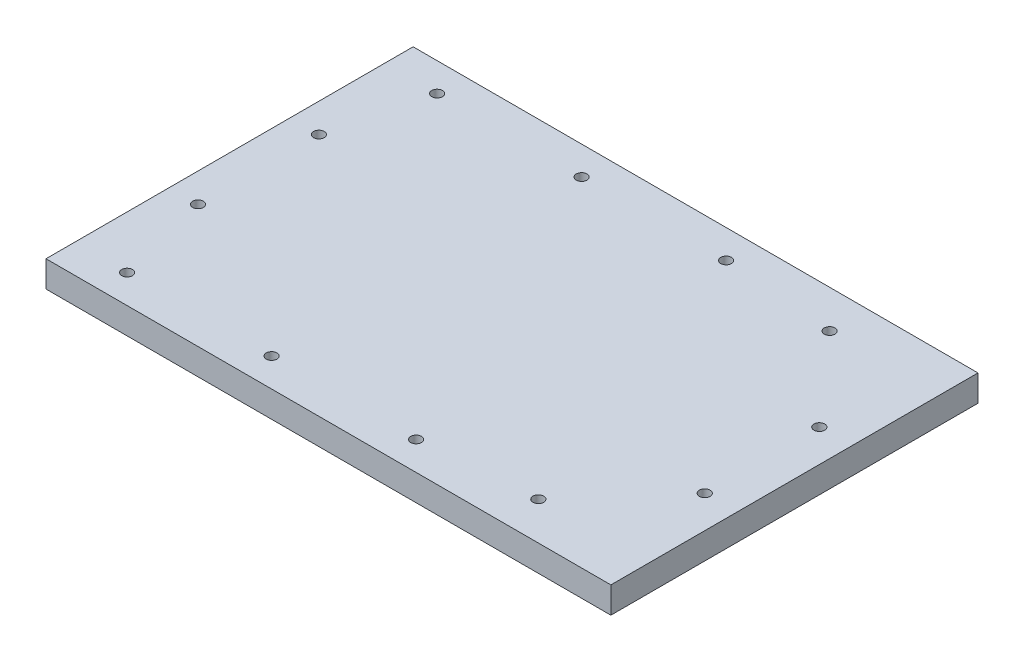
ISO-10303-21;
HEADER;
FILE_DESCRIPTION(('STEP AP214'),'2;1');
FILE_NAME('part.step','',(''),(''),'','','');
FILE_SCHEMA(('AUTOMOTIVE_DESIGN { 1 0 10303 214 1 1 1 1 }'));
ENDSEC;
DATA;
#1=APPLICATION_CONTEXT('core data for automotive mechanical design processes');
#2=APPLICATION_PROTOCOL_DEFINITION('international standard','automotive_design',2000,#1);
#3=PRODUCT_CONTEXT('',#1,'mechanical');
#4=PRODUCT('Part','Part','',(#3));
#5=PRODUCT_RELATED_PRODUCT_CATEGORY('part','',(#4));
#6=PRODUCT_DEFINITION_FORMATION('','',#4);
#7=PRODUCT_DEFINITION_CONTEXT('part definition',#1,'design');
#8=PRODUCT_DEFINITION('design','',#6,#7);
#9=PRODUCT_DEFINITION_SHAPE('','',#8);
#10=(LENGTH_UNIT() NAMED_UNIT(*) SI_UNIT(.MILLI.,.METRE.));
#11=(NAMED_UNIT(*) PLANE_ANGLE_UNIT() SI_UNIT($,.RADIAN.));
#12=(NAMED_UNIT(*) SI_UNIT($,.STERADIAN.) SOLID_ANGLE_UNIT());
#13=UNCERTAINTY_MEASURE_WITH_UNIT(LENGTH_MEASURE(1.E-05),#10,'distance_accuracy_value','');
#14=(GEOMETRIC_REPRESENTATION_CONTEXT(3) GLOBAL_UNCERTAINTY_ASSIGNED_CONTEXT((#13)) GLOBAL_UNIT_ASSIGNED_CONTEXT((#10,
#11,#12)) REPRESENTATION_CONTEXT('',''));
#15=CARTESIAN_POINT('',(0.,0.,0.));
#16=DIRECTION('',(0.,0.,1.));
#17=DIRECTION('',(1.,0.,0.));
#18=AXIS2_PLACEMENT_3D('',#15,#16,#17);
#19=CARTESIAN_POINT('',(215.,10.,0.133560895770796));
#20=DIRECTION('',(-1.,0.,0.));
#21=DIRECTION('',(0.,0.,1.));
#22=AXIS2_PLACEMENT_3D('',#19,#20,#21);
#23=PLANE('',#22);
#24=DIRECTION('',(0.,0.,-1.));
#25=VECTOR('',#24,1.);
#26=CARTESIAN_POINT('',(215.,0.,0.133560895770796));
#27=LINE('',#26,#25);
#28=CARTESIAN_POINT('',(215.,0.,139.866439104229));
#29=VERTEX_POINT('',#28);
#30=CARTESIAN_POINT('',(215.,0.,0.133560895770796));
#31=VERTEX_POINT('',#30);
#32=EDGE_CURVE('E103',#29,#31,#27,.T.);
#33=ORIENTED_EDGE('',*,*,#32,.T.);
#34=DIRECTION('',(0.,-1.,0.));
#35=VECTOR('',#34,1.);
#36=CARTESIAN_POINT('',(215.,10.,0.133560895770796));
#37=LINE('',#36,#35);
#38=CARTESIAN_POINT('',(215.,10.,0.133560895770796));
#39=VERTEX_POINT('',#38);
#40=EDGE_CURVE('E11',#39,#31,#37,.T.);
#41=ORIENTED_EDGE('',*,*,#40,.F.);
#42=DIRECTION('',(0.,0.,-1.));
#43=VECTOR('',#42,1.);
#44=CARTESIAN_POINT('',(215.,10.,0.133560895770796));
#45=LINE('',#44,#43);
#46=CARTESIAN_POINT('',(215.,10.,139.866439104229));
#47=VERTEX_POINT('',#46);
#48=EDGE_CURVE('E90',#47,#39,#45,.T.);
#49=ORIENTED_EDGE('',*,*,#48,.F.);
#50=DIRECTION('',(0.,-1.,0.));
#51=VECTOR('',#50,1.);
#52=CARTESIAN_POINT('',(215.,10.,139.866439104229));
#53=LINE('',#52,#51);
#54=EDGE_CURVE('E99',#47,#29,#53,.T.);
#55=ORIENTED_EDGE('',*,*,#54,.T.);
#56=EDGE_LOOP('',(#33,#41,#49,#55));
#57=FACE_BOUND('',#56,.T.);
#58=ADVANCED_FACE('F37',(#57),#23,.F.);
#59=CARTESIAN_POINT('',(215.,10.,0.133560895770796));
#60=DIRECTION('',(0.,0.,1.));
#61=DIRECTION('',(1.,0.,0.));
#62=AXIS2_PLACEMENT_3D('',#59,#60,#61);
#63=PLANE('',#62);
#64=DIRECTION('',(-1.,0.,0.));
#65=VECTOR('',#64,1.);
#66=CARTESIAN_POINT('',(215.,0.,0.133560895770796));
#67=LINE('',#66,#65);
#68=CARTESIAN_POINT('',(0.,0.,0.133560895770796));
#69=VERTEX_POINT('',#68);
#70=EDGE_CURVE('E94',#31,#69,#67,.T.);
#71=ORIENTED_EDGE('',*,*,#70,.T.);
#72=DIRECTION('',(0.,-1.,0.));
#73=VECTOR('',#72,1.);
#74=CARTESIAN_POINT('',(0.,10.,0.133560895770796));
#75=LINE('',#74,#73);
#76=CARTESIAN_POINT('',(0.,10.,0.133560895770796));
#77=VERTEX_POINT('',#76);
#78=EDGE_CURVE('E46',#77,#69,#75,.T.);
#79=ORIENTED_EDGE('',*,*,#78,.F.);
#80=DIRECTION('',(-1.,0.,0.));
#81=VECTOR('',#80,1.);
#82=CARTESIAN_POINT('',(215.,10.,0.133560895770796));
#83=LINE('',#82,#81);
#84=EDGE_CURVE('E85',#39,#77,#83,.T.);
#85=ORIENTED_EDGE('',*,*,#84,.F.);
#86=ORIENTED_EDGE('',*,*,#40,.T.);
#87=EDGE_LOOP('',(#71,#79,#85,#86));
#88=FACE_BOUND('',#87,.T.);
#89=ADVANCED_FACE('F93',(#88),#63,.F.);
#90=CARTESIAN_POINT('',(0.,10.,0.133560895770796));
#91=DIRECTION('',(1.,0.,0.));
#92=DIRECTION('',(0.,0.,-1.));
#93=AXIS2_PLACEMENT_3D('',#90,#91,#92);
#94=PLANE('',#93);
#95=DIRECTION('',(0.,0.,1.));
#96=VECTOR('',#95,1.);
#97=CARTESIAN_POINT('',(0.,0.,0.133560895770796));
#98=LINE('',#97,#96);
#99=CARTESIAN_POINT('',(0.,0.,139.866439104229));
#100=VERTEX_POINT('',#99);
#101=EDGE_CURVE('E72',#69,#100,#98,.T.);
#102=ORIENTED_EDGE('',*,*,#101,.T.);
#103=DIRECTION('',(0.,-1.,0.));
#104=VECTOR('',#103,1.);
#105=CARTESIAN_POINT('',(0.,10.,139.866439104229));
#106=LINE('',#105,#104);
#107=CARTESIAN_POINT('',(0.,10.,139.866439104229));
#108=VERTEX_POINT('',#107);
#109=EDGE_CURVE('E95',#108,#100,#106,.T.);
#110=ORIENTED_EDGE('',*,*,#109,.F.);
#111=DIRECTION('',(0.,0.,1.));
#112=VECTOR('',#111,1.);
#113=CARTESIAN_POINT('',(0.,10.,0.133560895770796));
#114=LINE('',#113,#112);
#115=EDGE_CURVE('E88',#77,#108,#114,.T.);
#116=ORIENTED_EDGE('',*,*,#115,.F.);
#117=ORIENTED_EDGE('',*,*,#78,.T.);
#118=EDGE_LOOP('',(#102,#110,#116,#117));
#119=FACE_BOUND('',#118,.T.);
#120=ADVANCED_FACE('F97',(#119),#94,.F.);
#121=CARTESIAN_POINT('',(215.,10.,139.866439104229));
#122=DIRECTION('',(0.,0.,-1.));
#123=DIRECTION('',(-1.,0.,0.));
#124=AXIS2_PLACEMENT_3D('',#121,#122,#123);
#125=PLANE('',#124);
#126=DIRECTION('',(1.,0.,0.));
#127=VECTOR('',#126,1.);
#128=CARTESIAN_POINT('',(215.,0.,139.866439104229));
#129=LINE('',#128,#127);
#130=EDGE_CURVE('E78',#100,#29,#129,.T.);
#131=ORIENTED_EDGE('',*,*,#130,.T.);
#132=ORIENTED_EDGE('',*,*,#54,.F.);
#133=DIRECTION('',(1.,0.,0.));
#134=VECTOR('',#133,1.);
#135=CARTESIAN_POINT('',(215.,10.,139.866439104229));
#136=LINE('',#135,#134);
#137=EDGE_CURVE('E55',#108,#47,#136,.T.);
#138=ORIENTED_EDGE('',*,*,#137,.F.);
#139=ORIENTED_EDGE('',*,*,#109,.T.);
#140=EDGE_LOOP('',(#131,#132,#138,#139));
#141=FACE_BOUND('',#140,.T.);
#142=ADVANCED_FACE('F179',(#141),#125,.F.);
#143=CARTESIAN_POINT('',(0.,10.,0.));
#144=DIRECTION('',(0.,-1.,0.));
#145=DIRECTION('',(0.,0.,-1.));
#146=AXIS2_PLACEMENT_3D('',#143,#144,#145);
#147=PLANE('',#146);
#148=CARTESIAN_POINT('',(11.0000002854057,10.,93.0000013997593));
#149=DIRECTION('',(0.,1.,0.));
#150=DIRECTION('',(0.,0.,1.));
#151=AXIS2_PLACEMENT_3D('',#148,#149,#150);
#152=CIRCLE('',#151,2.05000150168221);
#153=CARTESIAN_POINT('',(11.0000002854057,10.,95.0500029014415));
#154=VERTEX_POINT('',#153);
#155=EDGE_CURVE('E341',#154,#154,#152,.T.);
#156=ORIENTED_EDGE('',*,*,#155,.F.);
#157=EDGE_LOOP('',(#156));
#158=FACE_BOUND('',#157,.T.);
#159=CARTESIAN_POINT('',(10.9999998365835,10.,47.0000009935121));
#160=DIRECTION('',(0.,1.,0.));
#161=DIRECTION('',(0.,0.,1.));
#162=AXIS2_PLACEMENT_3D('',#159,#160,#161);
#163=CIRCLE('',#162,2.05000191681124);
#164=CARTESIAN_POINT('',(10.9999998365835,10.,49.0500029103234));
#165=VERTEX_POINT('',#164);
#166=EDGE_CURVE('E338',#165,#165,#163,.T.);
#167=ORIENTED_EDGE('',*,*,#166,.F.);
#168=EDGE_LOOP('',(#167));
#169=FACE_BOUND('',#168,.T.);
#170=CARTESIAN_POINT('',(20.0000048740137,10.,11.0000011958167));
#171=DIRECTION('',(0.,1.,0.));
#172=DIRECTION('',(0.,0.,1.));
#173=AXIS2_PLACEMENT_3D('',#170,#171,#172);
#174=CIRCLE('',#173,2.05000055715237);
#175=CARTESIAN_POINT('',(20.0000048740137,10.,13.0500017529691));
#176=VERTEX_POINT('',#175);
#177=EDGE_CURVE('E340',#176,#176,#174,.T.);
#178=ORIENTED_EDGE('',*,*,#177,.F.);
#179=EDGE_LOOP('',(#178));
#180=FACE_BOUND('',#179,.T.);
#181=CARTESIAN_POINT('',(75.0000002625459,10.,10.9999990840569));
#182=DIRECTION('',(0.,1.,0.));
#183=DIRECTION('',(0.,0.,1.));
#184=AXIS2_PLACEMENT_3D('',#181,#182,#183);
#185=CIRCLE('',#184,2.05000022846606);
#186=CARTESIAN_POINT('',(75.0000002625459,10.,13.0499993125229));
#187=VERTEX_POINT('',#186);
#188=EDGE_CURVE('E344',#187,#187,#185,.T.);
#189=ORIENTED_EDGE('',*,*,#188,.F.);
#190=EDGE_LOOP('',(#189));
#191=FACE_BOUND('',#190,.T.);
#192=CARTESIAN_POINT('',(130.000001693621,10.,10.999999377587));
#193=DIRECTION('',(0.,1.,0.));
#194=DIRECTION('',(0.,0.,1.));
#195=AXIS2_PLACEMENT_3D('',#192,#193,#194);
#196=CIRCLE('',#195,2.05000052199691);
#197=CARTESIAN_POINT('',(130.000001693621,10.,13.049999899584));
#198=VERTEX_POINT('',#197);
#199=EDGE_CURVE('E374',#198,#198,#196,.T.);
#200=ORIENTED_EDGE('',*,*,#199,.F.);
#201=EDGE_LOOP('',(#200));
#202=FACE_BOUND('',#201,.T.);
#203=CARTESIAN_POINT('',(172.961008674686,10.,14.5672297045611));
#204=DIRECTION('',(0.,1.,0.));
#205=DIRECTION('',(0.,0.,1.));
#206=AXIS2_PLACEMENT_3D('',#203,#204,#205);
#207=CIRCLE('',#206,2.04999872564438);
#208=CARTESIAN_POINT('',(172.961008674686,10.,16.6172284302055));
#209=VERTEX_POINT('',#208);
#210=EDGE_CURVE('E371',#209,#209,#207,.T.);
#211=ORIENTED_EDGE('',*,*,#210,.F.);
#212=EDGE_LOOP('',(#211));
#213=FACE_BOUND('',#212,.T.);
#214=CARTESIAN_POINT('',(202.661143568672,10.,48.18704294095));
#215=DIRECTION('',(0.,1.,0.));
#216=DIRECTION('',(0.,0.,1.));
#217=AXIS2_PLACEMENT_3D('',#214,#215,#216);
#218=CIRCLE('',#217,2.05000166957498);
#219=CARTESIAN_POINT('',(202.661143568672,10.,50.237044610525));
#220=VERTEX_POINT('',#219);
#221=EDGE_CURVE('E368',#220,#220,#218,.T.);
#222=ORIENTED_EDGE('',*,*,#221,.F.);
#223=EDGE_LOOP('',(#222));
#224=FACE_BOUND('',#223,.T.);
#225=CARTESIAN_POINT('',(202.6611328125,10.,91.8129600494126));
#226=DIRECTION('',(0.,1.,0.));
#227=DIRECTION('',(0.,0.,1.));
#228=AXIS2_PLACEMENT_3D('',#225,#226,#227);
#229=CIRCLE('',#228,2.05000488985599);
#230=CARTESIAN_POINT('',(202.6611328125,10.,93.8629649392686));
#231=VERTEX_POINT('',#230);
#232=EDGE_CURVE('E365',#231,#231,#229,.T.);
#233=ORIENTED_EDGE('',*,*,#232,.F.);
#234=EDGE_LOOP('',(#233));
#235=FACE_BOUND('',#234,.T.);
#236=CARTESIAN_POINT('',(172.961008423725,10.,125.432773785052));
#237=DIRECTION('',(0.,1.,0.));
#238=DIRECTION('',(0.,0.,1.));
#239=AXIS2_PLACEMENT_3D('',#236,#237,#238);
#240=CIRCLE('',#239,2.05000301024418);
#241=CARTESIAN_POINT('',(172.961008423725,10.,127.482776795296));
#242=VERTEX_POINT('',#241);
#243=EDGE_CURVE('E360',#242,#242,#240,.T.);
#244=ORIENTED_EDGE('',*,*,#243,.F.);
#245=EDGE_LOOP('',(#244));
#246=FACE_BOUND('',#245,.T.);
#247=CARTESIAN_POINT('',(130.00000186359,10.,128.999997495006));
#248=DIRECTION('',(0.,1.,0.));
#249=DIRECTION('',(0.,0.,1.));
#250=AXIS2_PLACEMENT_3D('',#247,#248,#249);
#251=CIRCLE('',#250,2.04999803591313);
#252=CARTESIAN_POINT('',(130.00000186359,10.,131.049995530919));
#253=VERTEX_POINT('',#252);
#254=EDGE_CURVE('E355',#253,#253,#251,.T.);
#255=ORIENTED_EDGE('',*,*,#254,.F.);
#256=EDGE_LOOP('',(#255));
#257=FACE_BOUND('',#256,.T.);
#258=CARTESIAN_POINT('',(74.9999997416251,10.,129.000001143844));
#259=DIRECTION('',(0.,1.,0.));
#260=DIRECTION('',(0.,0.,1.));
#261=AXIS2_PLACEMENT_3D('',#258,#259,#260);
#262=CIRCLE('',#261,2.04999620106591);
#263=CARTESIAN_POINT('',(74.9999997416251,10.,131.04999734491));
#264=VERTEX_POINT('',#263);
#265=EDGE_CURVE('E351',#264,#264,#262,.T.);
#266=ORIENTED_EDGE('',*,*,#265,.F.);
#267=EDGE_LOOP('',(#266));
#268=FACE_BOUND('',#267,.T.);
#269=CARTESIAN_POINT('',(20.0000030766647,10.,129.000001763663));
#270=DIRECTION('',(0.,1.,0.));
#271=DIRECTION('',(0.,0.,1.));
#272=AXIS2_PLACEMENT_3D('',#269,#270,#271);
#273=CIRCLE('',#272,2.04999698036307);
#274=CARTESIAN_POINT('',(20.0000030766647,10.,131.049998744026));
#275=VERTEX_POINT('',#274);
#276=EDGE_CURVE('E115',#275,#275,#273,.T.);
#277=ORIENTED_EDGE('',*,*,#276,.F.);
#278=EDGE_LOOP('',(#277));
#279=FACE_BOUND('',#278,.T.);
#280=ORIENTED_EDGE('',*,*,#48,.T.);
#281=ORIENTED_EDGE('',*,*,#84,.T.);
#282=ORIENTED_EDGE('',*,*,#115,.T.);
#283=ORIENTED_EDGE('',*,*,#137,.T.);
#284=EDGE_LOOP('',(#280,#281,#282,#283));
#285=FACE_BOUND('',#284,.T.);
#286=ADVANCED_FACE('F86',(#158,#169,#180,#191,#202,#213,#224,#235,#246,#257,#268,#279,#285),
#147,.F.);
#287=CARTESIAN_POINT('',(0.,0.,0.));
#288=DIRECTION('',(0.,-1.,0.));
#289=DIRECTION('',(0.,0.,-1.));
#290=AXIS2_PLACEMENT_3D('',#287,#288,#289);
#291=PLANE('',#290);
#292=CARTESIAN_POINT('',(11.0000002854057,0.,93.0000013997593));
#293=DIRECTION('',(0.,-1.,0.));
#294=DIRECTION('',(0.,0.,-1.));
#295=AXIS2_PLACEMENT_3D('',#292,#293,#294);
#296=CIRCLE('',#295,2.05000150168221);
#297=CARTESIAN_POINT('',(11.0000002854057,0.,90.9499998980771));
#298=VERTEX_POINT('',#297);
#299=EDGE_CURVE('E40',#298,#298,#296,.T.);
#300=ORIENTED_EDGE('',*,*,#299,.F.);
#301=EDGE_LOOP('',(#300));
#302=FACE_BOUND('',#301,.T.);
#303=CARTESIAN_POINT('',(10.9999998365835,0.,47.0000009935121));
#304=DIRECTION('',(0.,-1.,0.));
#305=DIRECTION('',(0.,0.,-1.));
#306=AXIS2_PLACEMENT_3D('',#303,#304,#305);
#307=CIRCLE('',#306,2.05000191681124);
#308=CARTESIAN_POINT('',(10.9999998365835,0.,44.9499990767009));
#309=VERTEX_POINT('',#308);
#310=EDGE_CURVE('E141',#309,#309,#307,.T.);
#311=ORIENTED_EDGE('',*,*,#310,.F.);
#312=EDGE_LOOP('',(#311));
#313=FACE_BOUND('',#312,.T.);
#314=CARTESIAN_POINT('',(20.0000048740137,0.,11.0000011958167));
#315=DIRECTION('',(0.,-1.,0.));
#316=DIRECTION('',(0.,0.,-1.));
#317=AXIS2_PLACEMENT_3D('',#314,#315,#316);
#318=CIRCLE('',#317,2.05000055715237);
#319=CARTESIAN_POINT('',(20.0000048740137,0.,8.95000063866435));
#320=VERTEX_POINT('',#319);
#321=EDGE_CURVE('E139',#320,#320,#318,.T.);
#322=ORIENTED_EDGE('',*,*,#321,.F.);
#323=EDGE_LOOP('',(#322));
#324=FACE_BOUND('',#323,.T.);
#325=CARTESIAN_POINT('',(75.0000002625459,0.,10.9999990840569));
#326=DIRECTION('',(0.,-1.,0.));
#327=DIRECTION('',(0.,0.,-1.));
#328=AXIS2_PLACEMENT_3D('',#325,#326,#327);
#329=CIRCLE('',#328,2.05000022846606);
#330=CARTESIAN_POINT('',(75.0000002625459,0.,8.9499988555908));
#331=VERTEX_POINT('',#330);
#332=EDGE_CURVE('E136',#331,#331,#329,.T.);
#333=ORIENTED_EDGE('',*,*,#332,.F.);
#334=EDGE_LOOP('',(#333));
#335=FACE_BOUND('',#334,.T.);
#336=CARTESIAN_POINT('',(130.000001693621,0.,10.999999377587));
#337=DIRECTION('',(0.,-1.,0.));
#338=DIRECTION('',(0.,0.,-1.));
#339=AXIS2_PLACEMENT_3D('',#336,#337,#338);
#340=CIRCLE('',#339,2.05000052199691);
#341=CARTESIAN_POINT('',(130.000001693621,0.,8.94999885559013));
#342=VERTEX_POINT('',#341);
#343=EDGE_CURVE('E133',#342,#342,#340,.T.);
#344=ORIENTED_EDGE('',*,*,#343,.F.);
#345=EDGE_LOOP('',(#344));
#346=FACE_BOUND('',#345,.T.);
#347=CARTESIAN_POINT('',(172.961008674686,0.,14.5672297045611));
#348=DIRECTION('',(0.,-1.,0.));
#349=DIRECTION('',(0.,0.,-1.));
#350=AXIS2_PLACEMENT_3D('',#347,#348,#349);
#351=CIRCLE('',#350,2.04999872564438);
#352=CARTESIAN_POINT('',(172.961008674686,0.,12.5172309789168));
#353=VERTEX_POINT('',#352);
#354=EDGE_CURVE('E130',#353,#353,#351,.T.);
#355=ORIENTED_EDGE('',*,*,#354,.F.);
#356=EDGE_LOOP('',(#355));
#357=FACE_BOUND('',#356,.T.);
#358=CARTESIAN_POINT('',(202.661143568672,0.,48.18704294095));
#359=DIRECTION('',(0.,-1.,0.));
#360=DIRECTION('',(0.,0.,-1.));
#361=AXIS2_PLACEMENT_3D('',#358,#359,#360);
#362=CIRCLE('',#361,2.05000166957498);
#363=CARTESIAN_POINT('',(202.661143568672,0.,46.1370412713751));
#364=VERTEX_POINT('',#363);
#365=EDGE_CURVE('E127',#364,#364,#362,.T.);
#366=ORIENTED_EDGE('',*,*,#365,.F.);
#367=EDGE_LOOP('',(#366));
#368=FACE_BOUND('',#367,.T.);
#369=CARTESIAN_POINT('',(202.6611328125,0.,91.8129600494126));
#370=DIRECTION('',(0.,-1.,0.));
#371=DIRECTION('',(0.,0.,-1.));
#372=AXIS2_PLACEMENT_3D('',#369,#370,#371);
#373=CIRCLE('',#372,2.05000488985599);
#374=CARTESIAN_POINT('',(202.6611328125,0.,89.7629551595566));
#375=VERTEX_POINT('',#374);
#376=EDGE_CURVE('E124',#375,#375,#373,.T.);
#377=ORIENTED_EDGE('',*,*,#376,.F.);
#378=EDGE_LOOP('',(#377));
#379=FACE_BOUND('',#378,.T.);
#380=CARTESIAN_POINT('',(172.961008423725,0.,125.432773785052));
#381=DIRECTION('',(0.,-1.,0.));
#382=DIRECTION('',(0.,0.,-1.));
#383=AXIS2_PLACEMENT_3D('',#380,#381,#382);
#384=CIRCLE('',#383,2.05000301024418);
#385=CARTESIAN_POINT('',(172.961008423725,0.,123.382770774808));
#386=VERTEX_POINT('',#385);
#387=EDGE_CURVE('E121',#386,#386,#384,.T.);
#388=ORIENTED_EDGE('',*,*,#387,.F.);
#389=EDGE_LOOP('',(#388));
#390=FACE_BOUND('',#389,.T.);
#391=CARTESIAN_POINT('',(130.00000186359,0.,128.999997495006));
#392=DIRECTION('',(0.,-1.,0.));
#393=DIRECTION('',(0.,0.,-1.));
#394=AXIS2_PLACEMENT_3D('',#391,#392,#393);
#395=CIRCLE('',#394,2.04999803591313);
#396=CARTESIAN_POINT('',(130.00000186359,0.,126.949999459093));
#397=VERTEX_POINT('',#396);
#398=EDGE_CURVE('E118',#397,#397,#395,.T.);
#399=ORIENTED_EDGE('',*,*,#398,.F.);
#400=EDGE_LOOP('',(#399));
#401=FACE_BOUND('',#400,.T.);
#402=CARTESIAN_POINT('',(74.9999997416251,0.,129.000001143844));
#403=DIRECTION('',(0.,-1.,0.));
#404=DIRECTION('',(0.,0.,-1.));
#405=AXIS2_PLACEMENT_3D('',#402,#403,#404);
#406=CIRCLE('',#405,2.04999620106591);
#407=CARTESIAN_POINT('',(74.9999997416251,0.,126.950004942778));
#408=VERTEX_POINT('',#407);
#409=EDGE_CURVE('E114',#408,#408,#406,.T.);
#410=ORIENTED_EDGE('',*,*,#409,.F.);
#411=EDGE_LOOP('',(#410));
#412=FACE_BOUND('',#411,.T.);
#413=CARTESIAN_POINT('',(20.0000030766647,0.,129.000001763663));
#414=DIRECTION('',(0.,-1.,0.));
#415=DIRECTION('',(0.,0.,-1.));
#416=AXIS2_PLACEMENT_3D('',#413,#414,#415);
#417=CIRCLE('',#416,2.04999698036307);
#418=CARTESIAN_POINT('',(20.0000030766647,0.,126.9500047833));
#419=VERTEX_POINT('',#418);
#420=EDGE_CURVE('E111',#419,#419,#417,.T.);
#421=ORIENTED_EDGE('',*,*,#420,.F.);
#422=EDGE_LOOP('',(#421));
#423=FACE_BOUND('',#422,.T.);
#424=ORIENTED_EDGE('',*,*,#32,.F.);
#425=ORIENTED_EDGE('',*,*,#130,.F.);
#426=ORIENTED_EDGE('',*,*,#101,.F.);
#427=ORIENTED_EDGE('',*,*,#70,.F.);
#428=EDGE_LOOP('',(#424,#425,#426,#427));
#429=FACE_BOUND('',#428,.T.);
#430=ADVANCED_FACE('F151',(#302,#313,#324,#335,#346,#357,#368,#379,#390,#401,#412,#423,#429),
#291,.T.);
#431=CARTESIAN_POINT('',(20.0000030766647,-1.2E-05,129.000001763663));
#432=DIRECTION('',(0.,1.,0.));
#433=DIRECTION('',(0.,0.,1.));
#434=AXIS2_PLACEMENT_3D('',#431,#432,#433);
#435=CYLINDRICAL_SURFACE('',#434,2.04999698036307);
#436=ORIENTED_EDGE('',*,*,#420,.T.);
#437=EDGE_LOOP('',(#436));
#438=FACE_BOUND('',#437,.T.);
#439=ORIENTED_EDGE('',*,*,#276,.T.);
#440=EDGE_LOOP('',(#439));
#441=FACE_BOUND('',#440,.T.);
#442=ADVANCED_FACE('F154',(#438,#441),#435,.F.);
#443=CARTESIAN_POINT('',(74.9999997416251,-1.2E-05,129.000001143844));
#444=DIRECTION('',(0.,1.,0.));
#445=DIRECTION('',(0.,0.,1.));
#446=AXIS2_PLACEMENT_3D('',#443,#444,#445);
#447=CYLINDRICAL_SURFACE('',#446,2.04999620106591);
#448=ORIENTED_EDGE('',*,*,#409,.T.);
#449=EDGE_LOOP('',(#448));
#450=FACE_BOUND('',#449,.T.);
#451=ORIENTED_EDGE('',*,*,#265,.T.);
#452=EDGE_LOOP('',(#451));
#453=FACE_BOUND('',#452,.T.);
#454=ADVANCED_FACE('F224',(#450,#453),#447,.F.);
#455=CARTESIAN_POINT('',(130.00000186359,-1.2E-05,128.999997495006));
#456=DIRECTION('',(0.,1.,0.));
#457=DIRECTION('',(0.,0.,1.));
#458=AXIS2_PLACEMENT_3D('',#455,#456,#457);
#459=CYLINDRICAL_SURFACE('',#458,2.04999803591313);
#460=ORIENTED_EDGE('',*,*,#398,.T.);
#461=EDGE_LOOP('',(#460));
#462=FACE_BOUND('',#461,.T.);
#463=ORIENTED_EDGE('',*,*,#254,.T.);
#464=EDGE_LOOP('',(#463));
#465=FACE_BOUND('',#464,.T.);
#466=ADVANCED_FACE('F234',(#462,#465),#459,.F.);
#467=CARTESIAN_POINT('',(172.961008423725,-1.2E-05,125.432773785052));
#468=DIRECTION('',(0.,1.,0.));
#469=DIRECTION('',(0.,0.,1.));
#470=AXIS2_PLACEMENT_3D('',#467,#468,#469);
#471=CYLINDRICAL_SURFACE('',#470,2.05000301024418);
#472=ORIENTED_EDGE('',*,*,#387,.T.);
#473=EDGE_LOOP('',(#472));
#474=FACE_BOUND('',#473,.T.);
#475=ORIENTED_EDGE('',*,*,#243,.T.);
#476=EDGE_LOOP('',(#475));
#477=FACE_BOUND('',#476,.T.);
#478=ADVANCED_FACE('F244',(#474,#477),#471,.F.);
#479=CARTESIAN_POINT('',(202.6611328125,-1.2E-05,91.8129600494126));
#480=DIRECTION('',(0.,1.,0.));
#481=DIRECTION('',(0.,0.,1.));
#482=AXIS2_PLACEMENT_3D('',#479,#480,#481);
#483=CYLINDRICAL_SURFACE('',#482,2.05000488985599);
#484=ORIENTED_EDGE('',*,*,#376,.T.);
#485=EDGE_LOOP('',(#484));
#486=FACE_BOUND('',#485,.T.);
#487=ORIENTED_EDGE('',*,*,#232,.T.);
#488=EDGE_LOOP('',(#487));
#489=FACE_BOUND('',#488,.T.);
#490=ADVANCED_FACE('F254',(#486,#489),#483,.F.);
#491=CARTESIAN_POINT('',(202.661143568672,-1.2E-05,48.18704294095));
#492=DIRECTION('',(0.,1.,0.));
#493=DIRECTION('',(0.,0.,1.));
#494=AXIS2_PLACEMENT_3D('',#491,#492,#493);
#495=CYLINDRICAL_SURFACE('',#494,2.05000166957498);
#496=ORIENTED_EDGE('',*,*,#365,.T.);
#497=EDGE_LOOP('',(#496));
#498=FACE_BOUND('',#497,.T.);
#499=ORIENTED_EDGE('',*,*,#221,.T.);
#500=EDGE_LOOP('',(#499));
#501=FACE_BOUND('',#500,.T.);
#502=ADVANCED_FACE('F264',(#498,#501),#495,.F.);
#503=CARTESIAN_POINT('',(172.961008674686,-1.2E-05,14.5672297045611));
#504=DIRECTION('',(0.,1.,0.));
#505=DIRECTION('',(0.,0.,1.));
#506=AXIS2_PLACEMENT_3D('',#503,#504,#505);
#507=CYLINDRICAL_SURFACE('',#506,2.04999872564438);
#508=ORIENTED_EDGE('',*,*,#354,.T.);
#509=EDGE_LOOP('',(#508));
#510=FACE_BOUND('',#509,.T.);
#511=ORIENTED_EDGE('',*,*,#210,.T.);
#512=EDGE_LOOP('',(#511));
#513=FACE_BOUND('',#512,.T.);
#514=ADVANCED_FACE('F274',(#510,#513),#507,.F.);
#515=CARTESIAN_POINT('',(130.000001693621,-1.2E-05,10.999999377587));
#516=DIRECTION('',(0.,1.,0.));
#517=DIRECTION('',(0.,0.,1.));
#518=AXIS2_PLACEMENT_3D('',#515,#516,#517);
#519=CYLINDRICAL_SURFACE('',#518,2.05000052199691);
#520=ORIENTED_EDGE('',*,*,#343,.T.);
#521=EDGE_LOOP('',(#520));
#522=FACE_BOUND('',#521,.T.);
#523=ORIENTED_EDGE('',*,*,#199,.T.);
#524=EDGE_LOOP('',(#523));
#525=FACE_BOUND('',#524,.T.);
#526=ADVANCED_FACE('F284',(#522,#525),#519,.F.);
#527=CARTESIAN_POINT('',(75.0000002625459,-1.2E-05,10.9999990840569));
#528=DIRECTION('',(0.,1.,0.));
#529=DIRECTION('',(0.,0.,1.));
#530=AXIS2_PLACEMENT_3D('',#527,#528,#529);
#531=CYLINDRICAL_SURFACE('',#530,2.05000022846606);
#532=ORIENTED_EDGE('',*,*,#332,.T.);
#533=EDGE_LOOP('',(#532));
#534=FACE_BOUND('',#533,.T.);
#535=ORIENTED_EDGE('',*,*,#188,.T.);
#536=EDGE_LOOP('',(#535));
#537=FACE_BOUND('',#536,.T.);
#538=ADVANCED_FACE('F294',(#534,#537),#531,.F.);
#539=CARTESIAN_POINT('',(20.0000048740137,-1.2E-05,11.0000011958167));
#540=DIRECTION('',(0.,1.,0.));
#541=DIRECTION('',(0.,0.,1.));
#542=AXIS2_PLACEMENT_3D('',#539,#540,#541);
#543=CYLINDRICAL_SURFACE('',#542,2.05000055715237);
#544=ORIENTED_EDGE('',*,*,#321,.T.);
#545=EDGE_LOOP('',(#544));
#546=FACE_BOUND('',#545,.T.);
#547=ORIENTED_EDGE('',*,*,#177,.T.);
#548=EDGE_LOOP('',(#547));
#549=FACE_BOUND('',#548,.T.);
#550=ADVANCED_FACE('F304',(#546,#549),#543,.F.);
#551=CARTESIAN_POINT('',(10.9999998365835,-1.2E-05,47.0000009935121));
#552=DIRECTION('',(0.,1.,0.));
#553=DIRECTION('',(0.,0.,1.));
#554=AXIS2_PLACEMENT_3D('',#551,#552,#553);
#555=CYLINDRICAL_SURFACE('',#554,2.05000191681124);
#556=ORIENTED_EDGE('',*,*,#310,.T.);
#557=EDGE_LOOP('',(#556));
#558=FACE_BOUND('',#557,.T.);
#559=ORIENTED_EDGE('',*,*,#166,.T.);
#560=EDGE_LOOP('',(#559));
#561=FACE_BOUND('',#560,.T.);
#562=ADVANCED_FACE('F314',(#558,#561),#555,.F.);
#563=CARTESIAN_POINT('',(11.0000002854057,-1.2E-05,93.0000013997593));
#564=DIRECTION('',(0.,1.,0.));
#565=DIRECTION('',(0.,0.,1.));
#566=AXIS2_PLACEMENT_3D('',#563,#564,#565);
#567=CYLINDRICAL_SURFACE('',#566,2.05000150168221);
#568=ORIENTED_EDGE('',*,*,#299,.T.);
#569=EDGE_LOOP('',(#568));
#570=FACE_BOUND('',#569,.T.);
#571=ORIENTED_EDGE('',*,*,#155,.T.);
#572=EDGE_LOOP('',(#571));
#573=FACE_BOUND('',#572,.T.);
#574=ADVANCED_FACE('F148',(#570,#573),#567,.F.);
#575=CLOSED_SHELL('',(#58,#89,#120,#142,#286,#430,#442,#454,#466,#478,#490,#502,#514,#526,#538,
#550,#562,#574));
#576=MANIFOLD_SOLID_BREP('B2',#575);
#577=ADVANCED_BREP_SHAPE_REPRESENTATION('',(#18,#576),#14);
#578=SHAPE_DEFINITION_REPRESENTATION(#9,#577);
ENDSEC;
END-ISO-10303-21;
